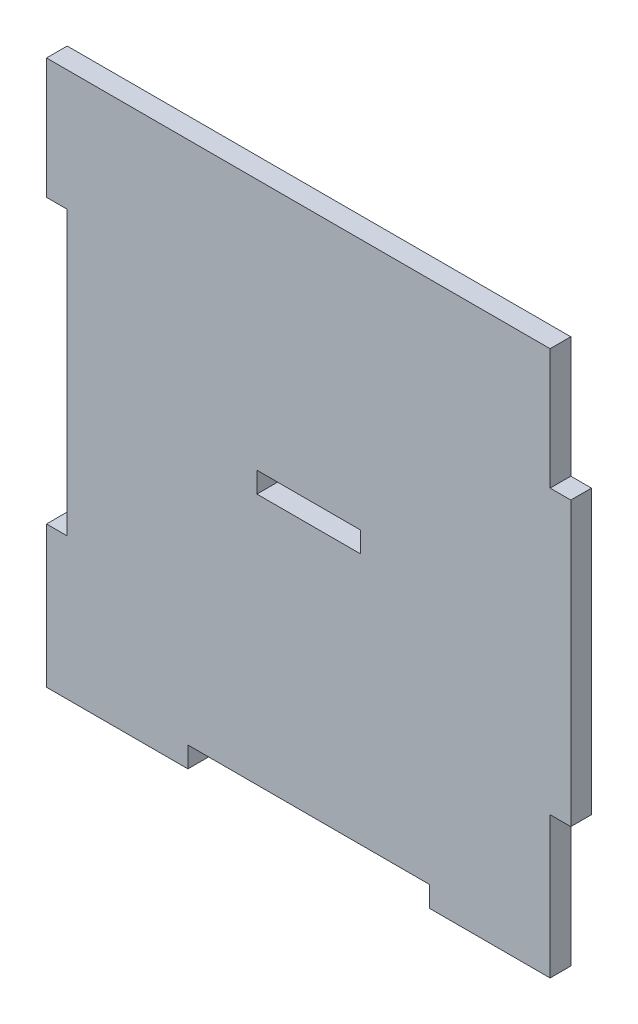
ISO-10303-21;
HEADER;
FILE_DESCRIPTION(('STEP AP214'),'2;1');
FILE_NAME('part.step','',(''),(''),'','','');
FILE_SCHEMA(('AUTOMOTIVE_DESIGN { 1 0 10303 214 1 1 1 1 }'));
ENDSEC;
DATA;
#1=APPLICATION_CONTEXT('core data for automotive mechanical design processes');
#2=APPLICATION_PROTOCOL_DEFINITION('international standard','automotive_design',2000,#1);
#3=PRODUCT_CONTEXT('',#1,'mechanical');
#4=PRODUCT('Part','Part','',(#3));
#5=PRODUCT_RELATED_PRODUCT_CATEGORY('part','',(#4));
#6=PRODUCT_DEFINITION_FORMATION('','',#4);
#7=PRODUCT_DEFINITION_CONTEXT('part definition',#1,'design');
#8=PRODUCT_DEFINITION('design','',#6,#7);
#9=PRODUCT_DEFINITION_SHAPE('','',#8);
#10=(LENGTH_UNIT() NAMED_UNIT(*) SI_UNIT(.MILLI.,.METRE.));
#11=(NAMED_UNIT(*) PLANE_ANGLE_UNIT() SI_UNIT($,.RADIAN.));
#12=(NAMED_UNIT(*) SI_UNIT($,.STERADIAN.) SOLID_ANGLE_UNIT());
#13=UNCERTAINTY_MEASURE_WITH_UNIT(LENGTH_MEASURE(1.E-05),#10,'distance_accuracy_value','');
#14=(GEOMETRIC_REPRESENTATION_CONTEXT(3) GLOBAL_UNCERTAINTY_ASSIGNED_CONTEXT((#13)) GLOBAL_UNIT_ASSIGNED_CONTEXT((#10,
#11,#12)) REPRESENTATION_CONTEXT('',''));
#15=CARTESIAN_POINT('',(0.,0.,0.));
#16=DIRECTION('',(0.,0.,1.));
#17=DIRECTION('',(1.,0.,0.));
#18=AXIS2_PLACEMENT_3D('',#15,#16,#17);
#19=CARTESIAN_POINT('',(35.,-20.5,3.));
#20=DIRECTION('',(0.,1.,0.));
#21=DIRECTION('',(-1.,0.,0.));
#22=AXIS2_PLACEMENT_3D('',#19,#20,#21);
#23=PLANE('',#22);
#24=DIRECTION('',(1.,0.,0.));
#25=VECTOR('',#24,1.);
#26=CARTESIAN_POINT('',(35.,-20.5,0.));
#27=LINE('',#26,#25);
#28=CARTESIAN_POINT('',(35.,-20.5,0.));
#29=VERTEX_POINT('',#28);
#30=CARTESIAN_POINT('',(38.,-20.5,0.));
#31=VERTEX_POINT('',#30);
#32=EDGE_CURVE('E207',#29,#31,#27,.T.);
#33=ORIENTED_EDGE('',*,*,#32,.T.);
#34=DIRECTION('',(0.,0.,-1.));
#35=VECTOR('',#34,1.);
#36=CARTESIAN_POINT('',(38.,-20.5,3.));
#37=LINE('',#36,#35);
#38=CARTESIAN_POINT('',(38.,-20.5,3.));
#39=VERTEX_POINT('',#38);
#40=EDGE_CURVE('E45',#39,#31,#37,.T.);
#41=ORIENTED_EDGE('',*,*,#40,.F.);
#42=DIRECTION('',(1.,0.,0.));
#43=VECTOR('',#42,1.);
#44=CARTESIAN_POINT('',(35.,-20.5,3.));
#45=LINE('',#44,#43);
#46=CARTESIAN_POINT('',(35.,-20.5,3.));
#47=VERTEX_POINT('',#46);
#48=EDGE_CURVE('E214',#47,#39,#45,.T.);
#49=ORIENTED_EDGE('',*,*,#48,.F.);
#50=DIRECTION('',(0.,0.,-1.));
#51=VECTOR('',#50,1.);
#52=CARTESIAN_POINT('',(35.,-20.5,3.));
#53=LINE('',#52,#51);
#54=EDGE_CURVE('E11',#47,#29,#53,.T.);
#55=ORIENTED_EDGE('',*,*,#54,.T.);
#56=EDGE_LOOP('',(#33,#41,#49,#55));
#57=FACE_BOUND('',#56,.T.);
#58=ADVANCED_FACE('F38',(#57),#23,.F.);
#59=CARTESIAN_POINT('',(38.,20.5,3.));
#60=DIRECTION('',(-1.,0.,0.));
#61=DIRECTION('',(0.,0.,1.));
#62=AXIS2_PLACEMENT_3D('',#59,#60,#61);
#63=PLANE('',#62);
#64=DIRECTION('',(0.,1.,0.));
#65=VECTOR('',#64,1.);
#66=CARTESIAN_POINT('',(38.,20.5,0.));
#67=LINE('',#66,#65);
#68=CARTESIAN_POINT('',(38.,20.5,0.));
#69=VERTEX_POINT('',#68);
#70=EDGE_CURVE('E248',#31,#69,#67,.T.);
#71=ORIENTED_EDGE('',*,*,#70,.T.);
#72=DIRECTION('',(0.,0.,-1.));
#73=VECTOR('',#72,1.);
#74=CARTESIAN_POINT('',(38.,20.5,3.));
#75=LINE('',#74,#73);
#76=CARTESIAN_POINT('',(38.,20.5,3.));
#77=VERTEX_POINT('',#76);
#78=EDGE_CURVE('E318',#77,#69,#75,.T.);
#79=ORIENTED_EDGE('',*,*,#78,.F.);
#80=DIRECTION('',(0.,1.,0.));
#81=VECTOR('',#80,1.);
#82=CARTESIAN_POINT('',(38.,20.5,3.));
#83=LINE('',#82,#81);
#84=EDGE_CURVE('E217',#39,#77,#83,.T.);
#85=ORIENTED_EDGE('',*,*,#84,.F.);
#86=ORIENTED_EDGE('',*,*,#40,.T.);
#87=EDGE_LOOP('',(#71,#79,#85,#86));
#88=FACE_BOUND('',#87,.T.);
#89=ADVANCED_FACE('F325',(#88),#63,.F.);
#90=CARTESIAN_POINT('',(35.,20.5,3.));
#91=DIRECTION('',(0.,-1.,0.));
#92=DIRECTION('',(1.,0.,0.));
#93=AXIS2_PLACEMENT_3D('',#90,#91,#92);
#94=PLANE('',#93);
#95=DIRECTION('',(-1.,0.,0.));
#96=VECTOR('',#95,1.);
#97=CARTESIAN_POINT('',(35.,20.5,0.));
#98=LINE('',#97,#96);
#99=CARTESIAN_POINT('',(35.,20.5,0.));
#100=VERTEX_POINT('',#99);
#101=EDGE_CURVE('E250',#69,#100,#98,.T.);
#102=ORIENTED_EDGE('',*,*,#101,.T.);
#103=DIRECTION('',(0.,0.,-1.));
#104=VECTOR('',#103,1.);
#105=CARTESIAN_POINT('',(35.,20.5,3.));
#106=LINE('',#105,#104);
#107=CARTESIAN_POINT('',(35.,20.5,3.));
#108=VERTEX_POINT('',#107);
#109=EDGE_CURVE('E315',#108,#100,#106,.T.);
#110=ORIENTED_EDGE('',*,*,#109,.F.);
#111=DIRECTION('',(-1.,0.,0.));
#112=VECTOR('',#111,1.);
#113=CARTESIAN_POINT('',(35.,20.5,3.));
#114=LINE('',#113,#112);
#115=EDGE_CURVE('E219',#77,#108,#114,.T.);
#116=ORIENTED_EDGE('',*,*,#115,.F.);
#117=ORIENTED_EDGE('',*,*,#78,.T.);
#118=EDGE_LOOP('',(#102,#110,#116,#117));
#119=FACE_BOUND('',#118,.T.);
#120=ADVANCED_FACE('F334',(#119),#94,.F.);
#121=CARTESIAN_POINT('',(35.,38.,3.));
#122=DIRECTION('',(-1.,0.,0.));
#123=DIRECTION('',(0.,-1.,0.));
#124=AXIS2_PLACEMENT_3D('',#121,#122,#123);
#125=PLANE('',#124);
#126=DIRECTION('',(0.,1.,0.));
#127=VECTOR('',#126,1.);
#128=CARTESIAN_POINT('',(35.,38.,0.));
#129=LINE('',#128,#127);
#130=CARTESIAN_POINT('',(35.,38.,0.));
#131=VERTEX_POINT('',#130);
#132=EDGE_CURVE('E252',#100,#131,#129,.T.);
#133=ORIENTED_EDGE('',*,*,#132,.T.);
#134=DIRECTION('',(0.,0.,-1.));
#135=VECTOR('',#134,1.);
#136=CARTESIAN_POINT('',(35.,38.,3.));
#137=LINE('',#136,#135);
#138=CARTESIAN_POINT('',(35.,38.,3.));
#139=VERTEX_POINT('',#138);
#140=EDGE_CURVE('E312',#139,#131,#137,.T.);
#141=ORIENTED_EDGE('',*,*,#140,.F.);
#142=DIRECTION('',(0.,1.,0.));
#143=VECTOR('',#142,1.);
#144=CARTESIAN_POINT('',(35.,38.,3.));
#145=LINE('',#144,#143);
#146=EDGE_CURVE('E221',#108,#139,#145,.T.);
#147=ORIENTED_EDGE('',*,*,#146,.F.);
#148=ORIENTED_EDGE('',*,*,#109,.T.);
#149=EDGE_LOOP('',(#133,#141,#147,#148));
#150=FACE_BOUND('',#149,.T.);
#151=ADVANCED_FACE('F338',(#150),#125,.F.);
#152=CARTESIAN_POINT('',(-38.,38.,3.));
#153=DIRECTION('',(0.,-1.,0.));
#154=DIRECTION('',(0.,0.,-1.));
#155=AXIS2_PLACEMENT_3D('',#152,#153,#154);
#156=PLANE('',#155);
#157=DIRECTION('',(-1.,0.,0.));
#158=VECTOR('',#157,1.);
#159=CARTESIAN_POINT('',(-38.,38.,0.));
#160=LINE('',#159,#158);
#161=CARTESIAN_POINT('',(-38.,38.,0.));
#162=VERTEX_POINT('',#161);
#163=EDGE_CURVE('E255',#131,#162,#160,.T.);
#164=ORIENTED_EDGE('',*,*,#163,.T.);
#165=DIRECTION('',(0.,0.,-1.));
#166=VECTOR('',#165,1.);
#167=CARTESIAN_POINT('',(-38.,38.,3.));
#168=LINE('',#167,#166);
#169=CARTESIAN_POINT('',(-38.,38.,3.));
#170=VERTEX_POINT('',#169);
#171=EDGE_CURVE('E309',#170,#162,#168,.T.);
#172=ORIENTED_EDGE('',*,*,#171,.F.);
#173=DIRECTION('',(-1.,0.,0.));
#174=VECTOR('',#173,1.);
#175=CARTESIAN_POINT('',(17.5,38.,3.));
#176=LINE('',#175,#174);
#177=EDGE_CURVE('E223',#139,#170,#176,.T.);
#178=ORIENTED_EDGE('',*,*,#177,.F.);
#179=ORIENTED_EDGE('',*,*,#140,.T.);
#180=EDGE_LOOP('',(#164,#172,#178,#179));
#181=FACE_BOUND('',#180,.T.);
#182=ADVANCED_FACE('F396',(#181),#156,.F.);
#183=CARTESIAN_POINT('',(-38.,20.5,3.));
#184=DIRECTION('',(1.,0.,0.));
#185=DIRECTION('',(0.,0.,-1.));
#186=AXIS2_PLACEMENT_3D('',#183,#184,#185);
#187=PLANE('',#186);
#188=DIRECTION('',(0.,-1.,0.));
#189=VECTOR('',#188,1.);
#190=CARTESIAN_POINT('',(-38.,20.5,0.));
#191=LINE('',#190,#189);
#192=CARTESIAN_POINT('',(-38.,20.5,0.));
#193=VERTEX_POINT('',#192);
#194=EDGE_CURVE('E257',#162,#193,#191,.T.);
#195=ORIENTED_EDGE('',*,*,#194,.T.);
#196=DIRECTION('',(0.,0.,-1.));
#197=VECTOR('',#196,1.);
#198=CARTESIAN_POINT('',(-38.,20.5,3.));
#199=LINE('',#198,#197);
#200=CARTESIAN_POINT('',(-38.,20.5,3.));
#201=VERTEX_POINT('',#200);
#202=EDGE_CURVE('E306',#201,#193,#199,.T.);
#203=ORIENTED_EDGE('',*,*,#202,.F.);
#204=DIRECTION('',(0.,-1.,0.));
#205=VECTOR('',#204,1.);
#206=CARTESIAN_POINT('',(-38.,20.5,3.));
#207=LINE('',#206,#205);
#208=EDGE_CURVE('E225',#170,#201,#207,.T.);
#209=ORIENTED_EDGE('',*,*,#208,.F.);
#210=ORIENTED_EDGE('',*,*,#171,.T.);
#211=EDGE_LOOP('',(#195,#203,#209,#210));
#212=FACE_BOUND('',#211,.T.);
#213=ADVANCED_FACE('F394',(#212),#187,.F.);
#214=CARTESIAN_POINT('',(-35.,20.5,3.));
#215=DIRECTION('',(0.,1.,0.));
#216=DIRECTION('',(0.,0.,1.));
#217=AXIS2_PLACEMENT_3D('',#214,#215,#216);
#218=PLANE('',#217);
#219=DIRECTION('',(1.,0.,0.));
#220=VECTOR('',#219,1.);
#221=CARTESIAN_POINT('',(-35.,20.5,0.));
#222=LINE('',#221,#220);
#223=CARTESIAN_POINT('',(-35.,20.5,0.));
#224=VERTEX_POINT('',#223);
#225=EDGE_CURVE('E259',#193,#224,#222,.T.);
#226=ORIENTED_EDGE('',*,*,#225,.T.);
#227=DIRECTION('',(0.,0.,-1.));
#228=VECTOR('',#227,1.);
#229=CARTESIAN_POINT('',(-35.,20.5,3.));
#230=LINE('',#229,#228);
#231=CARTESIAN_POINT('',(-35.,20.5,3.));
#232=VERTEX_POINT('',#231);
#233=EDGE_CURVE('E303',#232,#224,#230,.T.);
#234=ORIENTED_EDGE('',*,*,#233,.F.);
#235=DIRECTION('',(1.,0.,0.));
#236=VECTOR('',#235,1.);
#237=CARTESIAN_POINT('',(-35.,20.5,3.));
#238=LINE('',#237,#236);
#239=EDGE_CURVE('E227',#201,#232,#238,.T.);
#240=ORIENTED_EDGE('',*,*,#239,.F.);
#241=ORIENTED_EDGE('',*,*,#202,.T.);
#242=EDGE_LOOP('',(#226,#234,#240,#241));
#243=FACE_BOUND('',#242,.T.);
#244=ADVANCED_FACE('F389',(#243),#218,.F.);
#245=CARTESIAN_POINT('',(-35.,20.5,3.));
#246=DIRECTION('',(1.,0.,0.));
#247=DIRECTION('',(0.,0.,-1.));
#248=AXIS2_PLACEMENT_3D('',#245,#246,#247);
#249=PLANE('',#248);
#250=DIRECTION('',(0.,-1.,0.));
#251=VECTOR('',#250,1.);
#252=CARTESIAN_POINT('',(-35.,20.5,0.));
#253=LINE('',#252,#251);
#254=CARTESIAN_POINT('',(-35.,-20.5,0.));
#255=VERTEX_POINT('',#254);
#256=EDGE_CURVE('E261',#224,#255,#253,.T.);
#257=ORIENTED_EDGE('',*,*,#256,.T.);
#258=DIRECTION('',(0.,0.,-1.));
#259=VECTOR('',#258,1.);
#260=CARTESIAN_POINT('',(-35.,-20.5,3.));
#261=LINE('',#260,#259);
#262=CARTESIAN_POINT('',(-35.,-20.5,3.));
#263=VERTEX_POINT('',#262);
#264=EDGE_CURVE('E300',#263,#255,#261,.T.);
#265=ORIENTED_EDGE('',*,*,#264,.F.);
#266=DIRECTION('',(0.,-1.,0.));
#267=VECTOR('',#266,1.);
#268=CARTESIAN_POINT('',(-35.,20.5,3.));
#269=LINE('',#268,#267);
#270=EDGE_CURVE('E229',#232,#263,#269,.T.);
#271=ORIENTED_EDGE('',*,*,#270,.F.);
#272=ORIENTED_EDGE('',*,*,#233,.T.);
#273=EDGE_LOOP('',(#257,#265,#271,#272));
#274=FACE_BOUND('',#273,.T.);
#275=ADVANCED_FACE('F384',(#274),#249,.F.);
#276=CARTESIAN_POINT('',(-35.,-20.5,3.));
#277=DIRECTION('',(0.,-1.,0.));
#278=DIRECTION('',(0.,0.,-1.));
#279=AXIS2_PLACEMENT_3D('',#276,#277,#278);
#280=PLANE('',#279);
#281=DIRECTION('',(-1.,0.,0.));
#282=VECTOR('',#281,1.);
#283=CARTESIAN_POINT('',(-35.,-20.5,0.));
#284=LINE('',#283,#282);
#285=CARTESIAN_POINT('',(-38.,-20.5,0.));
#286=VERTEX_POINT('',#285);
#287=EDGE_CURVE('E263',#255,#286,#284,.T.);
#288=ORIENTED_EDGE('',*,*,#287,.T.);
#289=DIRECTION('',(0.,0.,-1.));
#290=VECTOR('',#289,1.);
#291=CARTESIAN_POINT('',(-38.,-20.5,3.));
#292=LINE('',#291,#290);
#293=CARTESIAN_POINT('',(-38.,-20.5,3.));
#294=VERTEX_POINT('',#293);
#295=EDGE_CURVE('E297',#294,#286,#292,.T.);
#296=ORIENTED_EDGE('',*,*,#295,.F.);
#297=DIRECTION('',(-1.,0.,0.));
#298=VECTOR('',#297,1.);
#299=CARTESIAN_POINT('',(-35.,-20.5,3.));
#300=LINE('',#299,#298);
#301=EDGE_CURVE('E231',#263,#294,#300,.T.);
#302=ORIENTED_EDGE('',*,*,#301,.F.);
#303=ORIENTED_EDGE('',*,*,#264,.T.);
#304=EDGE_LOOP('',(#288,#296,#302,#303));
#305=FACE_BOUND('',#304,.T.);
#306=ADVANCED_FACE('F379',(#305),#280,.F.);
#307=CARTESIAN_POINT('',(-38.,-38.,3.));
#308=DIRECTION('',(1.,0.,0.));
#309=DIRECTION('',(0.,0.,-1.));
#310=AXIS2_PLACEMENT_3D('',#307,#308,#309);
#311=PLANE('',#310);
#312=DIRECTION('',(0.,-1.,0.));
#313=VECTOR('',#312,1.);
#314=CARTESIAN_POINT('',(-38.,-38.,0.));
#315=LINE('',#314,#313);
#316=CARTESIAN_POINT('',(-38.,-41.,0.));
#317=VERTEX_POINT('',#316);
#318=EDGE_CURVE('E266',#286,#317,#315,.T.);
#319=ORIENTED_EDGE('',*,*,#318,.T.);
#320=DIRECTION('',(0.,0.,-1.));
#321=VECTOR('',#320,1.);
#322=CARTESIAN_POINT('',(-38.,-41.,3.));
#323=LINE('',#322,#321);
#324=CARTESIAN_POINT('',(-38.,-41.,3.));
#325=VERTEX_POINT('',#324);
#326=EDGE_CURVE('E294',#325,#317,#323,.T.);
#327=ORIENTED_EDGE('',*,*,#326,.F.);
#328=DIRECTION('',(0.,-1.,0.));
#329=VECTOR('',#328,1.);
#330=CARTESIAN_POINT('',(-38.,-20.5,3.));
#331=LINE('',#330,#329);
#332=EDGE_CURVE('E233',#294,#325,#331,.T.);
#333=ORIENTED_EDGE('',*,*,#332,.F.);
#334=ORIENTED_EDGE('',*,*,#295,.T.);
#335=EDGE_LOOP('',(#319,#327,#333,#334));
#336=FACE_BOUND('',#335,.T.);
#337=ADVANCED_FACE('F374',(#336),#311,.F.);
#338=CARTESIAN_POINT('',(-35.,-41.,3.));
#339=DIRECTION('',(0.,1.,0.));
#340=DIRECTION('',(0.,0.,1.));
#341=AXIS2_PLACEMENT_3D('',#338,#339,#340);
#342=PLANE('',#341);
#343=DIRECTION('',(1.,0.,0.));
#344=VECTOR('',#343,1.);
#345=CARTESIAN_POINT('',(-35.,-41.,0.));
#346=LINE('',#345,#344);
#347=CARTESIAN_POINT('',(-17.5,-41.,0.));
#348=VERTEX_POINT('',#347);
#349=EDGE_CURVE('E269',#317,#348,#346,.T.);
#350=ORIENTED_EDGE('',*,*,#349,.T.);
#351=DIRECTION('',(0.,0.,-1.));
#352=VECTOR('',#351,1.);
#353=CARTESIAN_POINT('',(-17.5,-41.,3.));
#354=LINE('',#353,#352);
#355=CARTESIAN_POINT('',(-17.5,-41.,3.));
#356=VERTEX_POINT('',#355);
#357=EDGE_CURVE('E291',#356,#348,#354,.T.);
#358=ORIENTED_EDGE('',*,*,#357,.F.);
#359=DIRECTION('',(1.,0.,0.));
#360=VECTOR('',#359,1.);
#361=CARTESIAN_POINT('',(-38.,-41.,3.));
#362=LINE('',#361,#360);
#363=EDGE_CURVE('E235',#325,#356,#362,.T.);
#364=ORIENTED_EDGE('',*,*,#363,.F.);
#365=ORIENTED_EDGE('',*,*,#326,.T.);
#366=EDGE_LOOP('',(#350,#358,#364,#365));
#367=FACE_BOUND('',#366,.T.);
#368=ADVANCED_FACE('F370',(#367),#342,.F.);
#369=CARTESIAN_POINT('',(-17.5,-38.,3.));
#370=DIRECTION('',(-1.,0.,0.));
#371=DIRECTION('',(0.,0.,1.));
#372=AXIS2_PLACEMENT_3D('',#369,#370,#371);
#373=PLANE('',#372);
#374=DIRECTION('',(0.,1.,0.));
#375=VECTOR('',#374,1.);
#376=CARTESIAN_POINT('',(-17.5,-38.,0.));
#377=LINE('',#376,#375);
#378=CARTESIAN_POINT('',(-17.5,-38.,0.));
#379=VERTEX_POINT('',#378);
#380=EDGE_CURVE('E271',#348,#379,#377,.T.);
#381=ORIENTED_EDGE('',*,*,#380,.T.);
#382=DIRECTION('',(0.,0.,-1.));
#383=VECTOR('',#382,1.);
#384=CARTESIAN_POINT('',(-17.5,-38.,3.));
#385=LINE('',#384,#383);
#386=CARTESIAN_POINT('',(-17.5,-38.,3.));
#387=VERTEX_POINT('',#386);
#388=EDGE_CURVE('E288',#387,#379,#385,.T.);
#389=ORIENTED_EDGE('',*,*,#388,.F.);
#390=DIRECTION('',(0.,1.,0.));
#391=VECTOR('',#390,1.);
#392=CARTESIAN_POINT('',(-17.5,-38.,3.));
#393=LINE('',#392,#391);
#394=EDGE_CURVE('E237',#356,#387,#393,.T.);
#395=ORIENTED_EDGE('',*,*,#394,.F.);
#396=ORIENTED_EDGE('',*,*,#357,.T.);
#397=EDGE_LOOP('',(#381,#389,#395,#396));
#398=FACE_BOUND('',#397,.T.);
#399=ADVANCED_FACE('F365',(#398),#373,.F.);
#400=CARTESIAN_POINT('',(-17.5,-38.,3.));
#401=DIRECTION('',(0.,1.,0.));
#402=DIRECTION('',(-1.,0.,0.));
#403=AXIS2_PLACEMENT_3D('',#400,#401,#402);
#404=PLANE('',#403);
#405=DIRECTION('',(1.,0.,0.));
#406=VECTOR('',#405,1.);
#407=CARTESIAN_POINT('',(-17.5,-38.,0.));
#408=LINE('',#407,#406);
#409=CARTESIAN_POINT('',(17.5,-38.,0.));
#410=VERTEX_POINT('',#409);
#411=EDGE_CURVE('E273',#379,#410,#408,.T.);
#412=ORIENTED_EDGE('',*,*,#411,.T.);
#413=DIRECTION('',(0.,0.,-1.));
#414=VECTOR('',#413,1.);
#415=CARTESIAN_POINT('',(17.5,-38.,3.));
#416=LINE('',#415,#414);
#417=CARTESIAN_POINT('',(17.5,-38.,3.));
#418=VERTEX_POINT('',#417);
#419=EDGE_CURVE('E285',#418,#410,#416,.T.);
#420=ORIENTED_EDGE('',*,*,#419,.F.);
#421=DIRECTION('',(1.,0.,0.));
#422=VECTOR('',#421,1.);
#423=CARTESIAN_POINT('',(-17.5,-38.,3.));
#424=LINE('',#423,#422);
#425=EDGE_CURVE('E239',#387,#418,#424,.T.);
#426=ORIENTED_EDGE('',*,*,#425,.F.);
#427=ORIENTED_EDGE('',*,*,#388,.T.);
#428=EDGE_LOOP('',(#412,#420,#426,#427));
#429=FACE_BOUND('',#428,.T.);
#430=ADVANCED_FACE('F361',(#429),#404,.F.);
#431=CARTESIAN_POINT('',(17.5,-41.,3.));
#432=DIRECTION('',(1.,0.,0.));
#433=DIRECTION('',(0.,1.,0.));
#434=AXIS2_PLACEMENT_3D('',#431,#432,#433);
#435=PLANE('',#434);
#436=DIRECTION('',(0.,-1.,0.));
#437=VECTOR('',#436,1.);
#438=CARTESIAN_POINT('',(17.5,-41.,0.));
#439=LINE('',#438,#437);
#440=CARTESIAN_POINT('',(17.5,-41.,0.));
#441=VERTEX_POINT('',#440);
#442=EDGE_CURVE('E275',#410,#441,#439,.T.);
#443=ORIENTED_EDGE('',*,*,#442,.T.);
#444=DIRECTION('',(0.,0.,-1.));
#445=VECTOR('',#444,1.);
#446=CARTESIAN_POINT('',(17.5,-41.,3.));
#447=LINE('',#446,#445);
#448=CARTESIAN_POINT('',(17.5,-41.,3.));
#449=VERTEX_POINT('',#448);
#450=EDGE_CURVE('E282',#449,#441,#447,.T.);
#451=ORIENTED_EDGE('',*,*,#450,.F.);
#452=DIRECTION('',(0.,-1.,0.));
#453=VECTOR('',#452,1.);
#454=CARTESIAN_POINT('',(17.5,-41.,3.));
#455=LINE('',#454,#453);
#456=EDGE_CURVE('E241',#418,#449,#455,.T.);
#457=ORIENTED_EDGE('',*,*,#456,.F.);
#458=ORIENTED_EDGE('',*,*,#419,.T.);
#459=EDGE_LOOP('',(#443,#451,#457,#458));
#460=FACE_BOUND('',#459,.T.);
#461=ADVANCED_FACE('F357',(#460),#435,.F.);
#462=CARTESIAN_POINT('',(35.,-41.,3.));
#463=DIRECTION('',(0.,1.,0.));
#464=DIRECTION('',(-1.,0.,0.));
#465=AXIS2_PLACEMENT_3D('',#462,#463,#464);
#466=PLANE('',#465);
#467=DIRECTION('',(1.,0.,0.));
#468=VECTOR('',#467,1.);
#469=CARTESIAN_POINT('',(35.,-41.,0.));
#470=LINE('',#469,#468);
#471=CARTESIAN_POINT('',(35.,-41.,0.));
#472=VERTEX_POINT('',#471);
#473=EDGE_CURVE('E277',#441,#472,#470,.T.);
#474=ORIENTED_EDGE('',*,*,#473,.T.);
#475=DIRECTION('',(0.,0.,-1.));
#476=VECTOR('',#475,1.);
#477=CARTESIAN_POINT('',(35.,-41.,3.));
#478=LINE('',#477,#476);
#479=CARTESIAN_POINT('',(35.,-41.,3.));
#480=VERTEX_POINT('',#479);
#481=EDGE_CURVE('E246',#480,#472,#478,.T.);
#482=ORIENTED_EDGE('',*,*,#481,.F.);
#483=DIRECTION('',(1.,0.,0.));
#484=VECTOR('',#483,1.);
#485=CARTESIAN_POINT('',(35.,-41.,3.));
#486=LINE('',#485,#484);
#487=EDGE_CURVE('E243',#449,#480,#486,.T.);
#488=ORIENTED_EDGE('',*,*,#487,.F.);
#489=ORIENTED_EDGE('',*,*,#450,.T.);
#490=EDGE_LOOP('',(#474,#482,#488,#489));
#491=FACE_BOUND('',#490,.T.);
#492=ADVANCED_FACE('F352',(#491),#466,.F.);
#493=CARTESIAN_POINT('',(35.,-38.,3.));
#494=DIRECTION('',(-1.,0.,0.));
#495=DIRECTION('',(0.,-1.,0.));
#496=AXIS2_PLACEMENT_3D('',#493,#494,#495);
#497=PLANE('',#496);
#498=DIRECTION('',(0.,1.,0.));
#499=VECTOR('',#498,1.);
#500=CARTESIAN_POINT('',(35.,-38.,0.));
#501=LINE('',#500,#499);
#502=EDGE_CURVE('E215',#472,#29,#501,.T.);
#503=ORIENTED_EDGE('',*,*,#502,.T.);
#504=ORIENTED_EDGE('',*,*,#54,.F.);
#505=DIRECTION('',(0.,1.,0.));
#506=VECTOR('',#505,1.);
#507=CARTESIAN_POINT('',(35.,-20.5,3.));
#508=LINE('',#507,#506);
#509=EDGE_CURVE('E211',#480,#47,#508,.T.);
#510=ORIENTED_EDGE('',*,*,#509,.F.);
#511=ORIENTED_EDGE('',*,*,#481,.T.);
#512=EDGE_LOOP('',(#503,#504,#510,#511));
#513=FACE_BOUND('',#512,.T.);
#514=ADVANCED_FACE('F346',(#513),#497,.F.);
#515=CARTESIAN_POINT('',(0.,0.,3.));
#516=DIRECTION('',(0.,0.,-1.));
#517=DIRECTION('',(-1.,0.,0.));
#518=AXIS2_PLACEMENT_3D('',#515,#516,#517);
#519=PLANE('',#518);
#520=DIRECTION('',(-1.,0.,0.));
#521=VECTOR('',#520,1.);
#522=CARTESIAN_POINT('',(-7.5,1.5,3.));
#523=LINE('',#522,#521);
#524=CARTESIAN_POINT('',(7.5,1.5,3.));
#525=VERTEX_POINT('',#524);
#526=CARTESIAN_POINT('',(-7.5,1.5,3.));
#527=VERTEX_POINT('',#526);
#528=EDGE_CURVE('E201',#525,#527,#523,.T.);
#529=ORIENTED_EDGE('',*,*,#528,.F.);
#530=DIRECTION('',(0.,1.,0.));
#531=VECTOR('',#530,1.);
#532=CARTESIAN_POINT('',(7.5,-1.5,3.));
#533=LINE('',#532,#531);
#534=CARTESIAN_POINT('',(7.5,-1.5,3.));
#535=VERTEX_POINT('',#534);
#536=EDGE_CURVE('E52',#535,#525,#533,.T.);
#537=ORIENTED_EDGE('',*,*,#536,.F.);
#538=DIRECTION('',(1.,0.,0.));
#539=VECTOR('',#538,1.);
#540=CARTESIAN_POINT('',(-7.5,-1.5,3.));
#541=LINE('',#540,#539);
#542=CARTESIAN_POINT('',(-7.5,-1.5,3.));
#543=VERTEX_POINT('',#542);
#544=EDGE_CURVE('E192',#543,#535,#541,.T.);
#545=ORIENTED_EDGE('',*,*,#544,.F.);
#546=DIRECTION('',(0.,-1.,0.));
#547=VECTOR('',#546,1.);
#548=CARTESIAN_POINT('',(-7.5,-1.5,3.));
#549=LINE('',#548,#547);
#550=EDGE_CURVE('E195',#527,#543,#549,.T.);
#551=ORIENTED_EDGE('',*,*,#550,.F.);
#552=EDGE_LOOP('',(#529,#537,#545,#551));
#553=FACE_BOUND('',#552,.T.);
#554=ORIENTED_EDGE('',*,*,#509,.T.);
#555=ORIENTED_EDGE('',*,*,#48,.T.);
#556=ORIENTED_EDGE('',*,*,#84,.T.);
#557=ORIENTED_EDGE('',*,*,#115,.T.);
#558=ORIENTED_EDGE('',*,*,#146,.T.);
#559=ORIENTED_EDGE('',*,*,#177,.T.);
#560=ORIENTED_EDGE('',*,*,#208,.T.);
#561=ORIENTED_EDGE('',*,*,#239,.T.);
#562=ORIENTED_EDGE('',*,*,#270,.T.);
#563=ORIENTED_EDGE('',*,*,#301,.T.);
#564=ORIENTED_EDGE('',*,*,#332,.T.);
#565=ORIENTED_EDGE('',*,*,#363,.T.);
#566=ORIENTED_EDGE('',*,*,#394,.T.);
#567=ORIENTED_EDGE('',*,*,#425,.T.);
#568=ORIENTED_EDGE('',*,*,#456,.T.);
#569=ORIENTED_EDGE('',*,*,#487,.T.);
#570=EDGE_LOOP('',(#554,#555,#556,#557,#558,#559,#560,#561,#562,#563,#564,#565,#566,#567,#568,#569));
#571=FACE_BOUND('',#570,.T.);
#572=ADVANCED_FACE('F342',(#553,#571),#519,.F.);
#573=CARTESIAN_POINT('',(0.,0.,0.));
#574=DIRECTION('',(0.,0.,-1.));
#575=DIRECTION('',(-1.,0.,0.));
#576=AXIS2_PLACEMENT_3D('',#573,#574,#575);
#577=PLANE('',#576);
#578=DIRECTION('',(0.,1.,0.));
#579=VECTOR('',#578,1.);
#580=CARTESIAN_POINT('',(7.5,-1.5,0.));
#581=LINE('',#580,#579);
#582=CARTESIAN_POINT('',(7.5,-1.5,0.));
#583=VERTEX_POINT('',#582);
#584=CARTESIAN_POINT('',(7.5,1.5,0.));
#585=VERTEX_POINT('',#584);
#586=EDGE_CURVE('E176',#583,#585,#581,.T.);
#587=ORIENTED_EDGE('',*,*,#586,.T.);
#588=DIRECTION('',(-1.,0.,0.));
#589=VECTOR('',#588,1.);
#590=CARTESIAN_POINT('',(-7.5,1.5,0.));
#591=LINE('',#590,#589);
#592=CARTESIAN_POINT('',(-7.5,1.5,0.));
#593=VERTEX_POINT('',#592);
#594=EDGE_CURVE('E185',#585,#593,#591,.T.);
#595=ORIENTED_EDGE('',*,*,#594,.T.);
#596=DIRECTION('',(0.,-1.,0.));
#597=VECTOR('',#596,1.);
#598=CARTESIAN_POINT('',(-7.5,-1.5,0.));
#599=LINE('',#598,#597);
#600=CARTESIAN_POINT('',(-7.5,-1.5,0.));
#601=VERTEX_POINT('',#600);
#602=EDGE_CURVE('E60',#593,#601,#599,.T.);
#603=ORIENTED_EDGE('',*,*,#602,.T.);
#604=DIRECTION('',(1.,0.,0.));
#605=VECTOR('',#604,1.);
#606=CARTESIAN_POINT('',(-7.5,-1.5,0.));
#607=LINE('',#606,#605);
#608=EDGE_CURVE('E182',#601,#583,#607,.T.);
#609=ORIENTED_EDGE('',*,*,#608,.T.);
#610=EDGE_LOOP('',(#587,#595,#603,#609));
#611=FACE_BOUND('',#610,.T.);
#612=ORIENTED_EDGE('',*,*,#32,.F.);
#613=ORIENTED_EDGE('',*,*,#502,.F.);
#614=ORIENTED_EDGE('',*,*,#473,.F.);
#615=ORIENTED_EDGE('',*,*,#442,.F.);
#616=ORIENTED_EDGE('',*,*,#411,.F.);
#617=ORIENTED_EDGE('',*,*,#380,.F.);
#618=ORIENTED_EDGE('',*,*,#349,.F.);
#619=ORIENTED_EDGE('',*,*,#318,.F.);
#620=ORIENTED_EDGE('',*,*,#287,.F.);
#621=ORIENTED_EDGE('',*,*,#256,.F.);
#622=ORIENTED_EDGE('',*,*,#225,.F.);
#623=ORIENTED_EDGE('',*,*,#194,.F.);
#624=ORIENTED_EDGE('',*,*,#163,.F.);
#625=ORIENTED_EDGE('',*,*,#132,.F.);
#626=ORIENTED_EDGE('',*,*,#101,.F.);
#627=ORIENTED_EDGE('',*,*,#70,.F.);
#628=EDGE_LOOP('',(#612,#613,#614,#615,#616,#617,#618,#619,#620,#621,#622,#623,#624,#625,#626,#627));
#629=FACE_BOUND('',#628,.T.);
#630=ADVANCED_FACE('F189',(#611,#629),#577,.T.);
#631=CARTESIAN_POINT('',(7.5,-1.5,0.));
#632=DIRECTION('',(1.,0.,0.));
#633=DIRECTION('',(0.,0.,-1.));
#634=AXIS2_PLACEMENT_3D('',#631,#632,#633);
#635=PLANE('',#634);
#636=ORIENTED_EDGE('',*,*,#536,.T.);
#637=DIRECTION('',(0.,0.,1.));
#638=VECTOR('',#637,1.);
#639=CARTESIAN_POINT('',(7.5,1.5,0.));
#640=LINE('',#639,#638);
#641=EDGE_CURVE('E172',#585,#525,#640,.T.);
#642=ORIENTED_EDGE('',*,*,#641,.F.);
#643=ORIENTED_EDGE('',*,*,#586,.F.);
#644=DIRECTION('',(0.,0.,1.));
#645=VECTOR('',#644,1.);
#646=CARTESIAN_POINT('',(7.5,-1.5,0.));
#647=LINE('',#646,#645);
#648=EDGE_CURVE('E205',#583,#535,#647,.T.);
#649=ORIENTED_EDGE('',*,*,#648,.T.);
#650=EDGE_LOOP('',(#636,#642,#643,#649));
#651=FACE_BOUND('',#650,.T.);
#652=ADVANCED_FACE('F174',(#651),#635,.F.);
#653=CARTESIAN_POINT('',(-7.5,-1.5,0.));
#654=DIRECTION('',(0.,-1.,0.));
#655=DIRECTION('',(0.,0.,-1.));
#656=AXIS2_PLACEMENT_3D('',#653,#654,#655);
#657=PLANE('',#656);
#658=ORIENTED_EDGE('',*,*,#544,.T.);
#659=ORIENTED_EDGE('',*,*,#648,.F.);
#660=ORIENTED_EDGE('',*,*,#608,.F.);
#661=DIRECTION('',(0.,0.,1.));
#662=VECTOR('',#661,1.);
#663=CARTESIAN_POINT('',(-7.5,-1.5,0.));
#664=LINE('',#663,#662);
#665=EDGE_CURVE('E208',#601,#543,#664,.T.);
#666=ORIENTED_EDGE('',*,*,#665,.T.);
#667=EDGE_LOOP('',(#658,#659,#660,#666));
#668=FACE_BOUND('',#667,.T.);
#669=ADVANCED_FACE('F536',(#668),#657,.F.);
#670=CARTESIAN_POINT('',(-7.5,-1.5,0.));
#671=DIRECTION('',(-1.,0.,0.));
#672=DIRECTION('',(0.,0.,1.));
#673=AXIS2_PLACEMENT_3D('',#670,#671,#672);
#674=PLANE('',#673);
#675=ORIENTED_EDGE('',*,*,#550,.T.);
#676=ORIENTED_EDGE('',*,*,#665,.F.);
#677=ORIENTED_EDGE('',*,*,#602,.F.);
#678=DIRECTION('',(0.,0.,1.));
#679=VECTOR('',#678,1.);
#680=CARTESIAN_POINT('',(-7.5,1.5,0.));
#681=LINE('',#680,#679);
#682=EDGE_CURVE('E181',#593,#527,#681,.T.);
#683=ORIENTED_EDGE('',*,*,#682,.T.);
#684=EDGE_LOOP('',(#675,#676,#677,#683));
#685=FACE_BOUND('',#684,.T.);
#686=ADVANCED_FACE('F545',(#685),#674,.F.);
#687=CARTESIAN_POINT('',(-7.5,1.5,0.));
#688=DIRECTION('',(0.,1.,0.));
#689=DIRECTION('',(0.,0.,1.));
#690=AXIS2_PLACEMENT_3D('',#687,#688,#689);
#691=PLANE('',#690);
#692=ORIENTED_EDGE('',*,*,#528,.T.);
#693=ORIENTED_EDGE('',*,*,#682,.F.);
#694=ORIENTED_EDGE('',*,*,#594,.F.);
#695=ORIENTED_EDGE('',*,*,#641,.T.);
#696=EDGE_LOOP('',(#692,#693,#694,#695));
#697=FACE_BOUND('',#696,.T.);
#698=ADVANCED_FACE('F186',(#697),#691,.F.);
#699=CLOSED_SHELL('',(#58,#89,#120,#151,#182,#213,#244,#275,#306,#337,#368,#399,#430,#461,#492,
#514,#572,#630,#652,#669,#686,#698));
#700=MANIFOLD_SOLID_BREP('B2',#699);
#701=ADVANCED_BREP_SHAPE_REPRESENTATION('',(#18,#700),#14);
#702=SHAPE_DEFINITION_REPRESENTATION(#9,#701);
ENDSEC;
END-ISO-10303-21;
